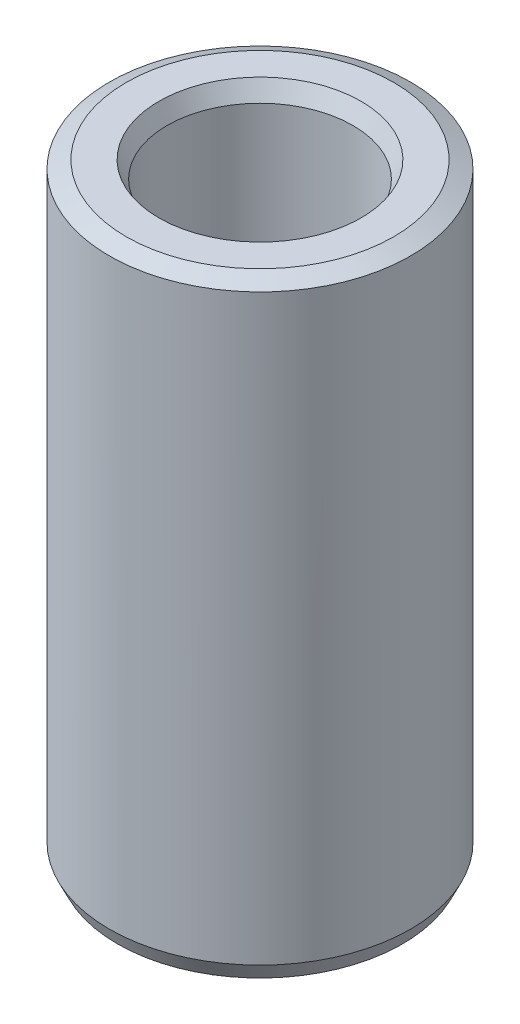
ISO-10303-21;
HEADER;
FILE_DESCRIPTION(('STEP AP214'),'2;1');
FILE_NAME('part.step','',(''),(''),'','','');
FILE_SCHEMA(('AUTOMOTIVE_DESIGN { 1 0 10303 214 1 1 1 1 }'));
ENDSEC;
DATA;
#1=APPLICATION_CONTEXT('core data for automotive mechanical design processes');
#2=APPLICATION_PROTOCOL_DEFINITION('international standard','automotive_design',2000,#1);
#3=PRODUCT_CONTEXT('',#1,'mechanical');
#4=PRODUCT('Part','Part','',(#3));
#5=PRODUCT_RELATED_PRODUCT_CATEGORY('part','',(#4));
#6=PRODUCT_DEFINITION_FORMATION('','',#4);
#7=PRODUCT_DEFINITION_CONTEXT('part definition',#1,'design');
#8=PRODUCT_DEFINITION('design','',#6,#7);
#9=PRODUCT_DEFINITION_SHAPE('','',#8);
#10=(LENGTH_UNIT() NAMED_UNIT(*) SI_UNIT(.MILLI.,.METRE.));
#11=(NAMED_UNIT(*) PLANE_ANGLE_UNIT() SI_UNIT($,.RADIAN.));
#12=(NAMED_UNIT(*) SI_UNIT($,.STERADIAN.) SOLID_ANGLE_UNIT());
#13=UNCERTAINTY_MEASURE_WITH_UNIT(LENGTH_MEASURE(1.E-05),#10,'distance_accuracy_value','');
#14=(GEOMETRIC_REPRESENTATION_CONTEXT(3) GLOBAL_UNCERTAINTY_ASSIGNED_CONTEXT((#13)) GLOBAL_UNIT_ASSIGNED_CONTEXT((#10,
#11,#12)) REPRESENTATION_CONTEXT('',''));
#15=CARTESIAN_POINT('',(0.,0.,0.));
#16=DIRECTION('',(0.,0.,1.));
#17=DIRECTION('',(1.,0.,0.));
#18=AXIS2_PLACEMENT_3D('',#15,#16,#17);
#19=CARTESIAN_POINT('',(0.,232.12143112946,0.));
#20=DIRECTION('',(0.,-1.,0.));
#21=DIRECTION('',(0.,0.,-1.));
#22=AXIS2_PLACEMENT_3D('',#19,#20,#21);
#23=CYLINDRICAL_SURFACE('',#22,57.5);
#24=CARTESIAN_POINT('',(0.,6.45651288711924,0.));
#25=DIRECTION('',(0.,1.,0.));
#26=DIRECTION('',(0.,0.,1.));
#27=AXIS2_PLACEMENT_3D('',#24,#25,#26);
#28=CIRCLE('',#27,57.5);
#29=CARTESIAN_POINT('',(0.,6.45651288711921,-57.5));
#30=VERTEX_POINT('',#29);
#31=EDGE_CURVE('E10',#30,#30,#28,.T.);
#32=CARTESIAN_POINT('',(0.,229.018245278419,0.));
#33=DIRECTION('',(0.,1.,0.));
#34=DIRECTION('',(0.,0.,1.));
#35=AXIS2_PLACEMENT_3D('',#32,#33,#34);
#36=CIRCLE('',#35,57.5);
#37=CARTESIAN_POINT('',(0.,229.018245278419,-57.5));
#38=VERTEX_POINT('',#37);
#39=EDGE_CURVE('E50',#38,#38,#36,.F.);
#40=CARTESIAN_POINT('',(0.,6.45651288711921,-57.5));
#41=CARTESIAN_POINT('',(0.,8.77486426619524,-57.5));
#42=CARTESIAN_POINT('',(0.,11.0932156452713,-57.5));
#43=CARTESIAN_POINT('',(0.,15.7299184034233,-57.5));
#44=CARTESIAN_POINT('',(0.,18.0482697824994,-57.5));
#45=CARTESIAN_POINT('',(0.,22.6849725406515,-57.5));
#46=CARTESIAN_POINT('',(0.,25.0033239197275,-57.5));
#47=CARTESIAN_POINT('',(0.,29.6400266778796,-57.5));
#48=CARTESIAN_POINT('',(0.,31.9583780569556,-57.5));
#49=CARTESIAN_POINT('',(0.,36.5950808151077,-57.5));
#50=CARTESIAN_POINT('',(0.,38.9134321941837,-57.5));
#51=CARTESIAN_POINT('',(0.,43.5501349523358,-57.5));
#52=CARTESIAN_POINT('',(0.,45.8684863314118,-57.5));
#53=CARTESIAN_POINT('',(0.,50.5051890895639,-57.5));
#54=CARTESIAN_POINT('',(0.,52.8235404686399,-57.5));
#55=CARTESIAN_POINT('',(0.,57.460243226792,-57.5));
#56=CARTESIAN_POINT('',(0.,59.7785946058681,-57.5));
#57=CARTESIAN_POINT('',(0.,64.4152973640201,-57.5));
#58=CARTESIAN_POINT('',(0.,66.7336487430962,-57.5));
#59=CARTESIAN_POINT('',(0.,71.3703515012482,-57.5));
#60=CARTESIAN_POINT('',(0.,73.6887028803243,-57.5));
#61=CARTESIAN_POINT('',(0.,78.3254056384764,-57.5));
#62=CARTESIAN_POINT('',(0.,80.6437570175524,-57.5));
#63=CARTESIAN_POINT('',(0.,85.2804597757045,-57.5));
#64=CARTESIAN_POINT('',(0.,87.5988111547805,-57.5));
#65=CARTESIAN_POINT('',(0.,92.2355139129326,-57.5));
#66=CARTESIAN_POINT('',(0.,94.5538652920086,-57.5));
#67=CARTESIAN_POINT('',(0.,99.1905680501607,-57.5));
#68=CARTESIAN_POINT('',(0.,101.508919429237,-57.5));
#69=CARTESIAN_POINT('',(0.,106.145622187389,-57.5));
#70=CARTESIAN_POINT('',(0.,108.463973566465,-57.5));
#71=CARTESIAN_POINT('',(0.,113.100676324617,-57.5));
#72=CARTESIAN_POINT('',(0.,115.419027703693,-57.5));
#73=CARTESIAN_POINT('',(0.,120.055730461845,-57.5));
#74=CARTESIAN_POINT('',(0.,122.374081840921,-57.5));
#75=CARTESIAN_POINT('',(0.,127.010784599073,-57.5));
#76=CARTESIAN_POINT('',(0.,129.329135978149,-57.5));
#77=CARTESIAN_POINT('',(0.,133.965838736301,-57.5));
#78=CARTESIAN_POINT('',(0.,136.284190115377,-57.5));
#79=CARTESIAN_POINT('',(0.,140.920892873529,-57.5));
#80=CARTESIAN_POINT('',(0.,143.239244252605,-57.5));
#81=CARTESIAN_POINT('',(0.,147.875947010757,-57.5));
#82=CARTESIAN_POINT('',(0.,150.194298389834,-57.5));
#83=CARTESIAN_POINT('',(0.,154.831001147986,-57.5));
#84=CARTESIAN_POINT('',(0.,157.149352527062,-57.5));
#85=CARTESIAN_POINT('',(0.,161.786055285214,-57.5));
#86=CARTESIAN_POINT('',(0.,164.10440666429,-57.5));
#87=CARTESIAN_POINT('',(0.,168.741109422442,-57.5));
#88=CARTESIAN_POINT('',(0.,171.059460801518,-57.5));
#89=CARTESIAN_POINT('',(0.,175.69616355967,-57.5));
#90=CARTESIAN_POINT('',(0.,178.014514938746,-57.5));
#91=CARTESIAN_POINT('',(0.,182.651217696898,-57.5));
#92=CARTESIAN_POINT('',(0.,184.969569075974,-57.5));
#93=CARTESIAN_POINT('',(0.,189.606271834126,-57.5));
#94=CARTESIAN_POINT('',(0.,191.924623213202,-57.5));
#95=CARTESIAN_POINT('',(0.,196.561325971354,-57.5));
#96=CARTESIAN_POINT('',(0.,198.87967735043,-57.5));
#97=CARTESIAN_POINT('',(0.,203.516380108582,-57.5));
#98=CARTESIAN_POINT('',(0.,205.834731487658,-57.5));
#99=CARTESIAN_POINT('',(0.,210.47143424581,-57.5));
#100=CARTESIAN_POINT('',(0.,212.789785624886,-57.5));
#101=CARTESIAN_POINT('',(0.,217.426488383039,-57.5));
#102=CARTESIAN_POINT('',(0.,219.744839762115,-57.5));
#103=CARTESIAN_POINT('',(0.,224.381542520267,-57.5));
#104=CARTESIAN_POINT('',(0.,226.699893899343,-57.5));
#105=CARTESIAN_POINT('',(0.,229.018245278419,-57.5));
#106=B_SPLINE_CURVE_WITH_KNOTS('',3,(#40,#41,#42,#43,#44,#45,#46,#47,#48,#49,#50,#51,#52,#53,
#54,#55,#56,#57,#58,#59,#60,#61,#62,#63,#64,#65,#66,#67,#68,#69,#70,#71,#72,#73,#74,#75,#76,#77,
#78,#79,#80,#81,#82,#83,#84,#85,#86,#87,#88,#89,#90,#91,#92,#93,#94,#95,#96,#97,#98,#99,#100,
#101,#102,#103,#104,#105),.UNSPECIFIED.,.F.,.F.,(4,2,2,2,2,2,2,2,2,2,2,2,2,2,2,2,2,2,2,2,2,2,2,
2,2,2,2,2,2,2,2,2,4),(0.,6.95505413722811,13.9101082744562,20.8651624116843,27.8202165489125,
34.7752706861406,41.7303248233687,48.6853789605968,55.6404330978249,62.595487235053,
69.5505413722811,76.5055955095092,83.4606496467373,90.4157037839655,97.3707579211935,
104.325812058422,111.28086619565,118.235920332878,125.190974470106,132.146028607334,
139.101082744562,146.05613688179,153.011191019018,159.966245156247,166.921299293475,
173.876353430703,180.831407567931,187.786461705159,194.741515842387,201.696569979615,
208.651624116843,215.606678254071,222.5617323913),.UNSPECIFIED.);
#107=EDGE_CURVE('BSEAM39',#30,#38,#106,.T.);
#108=ORIENTED_EDGE('',*,*,#31,.T.);
#109=ORIENTED_EDGE('',*,*,#39,.T.);
#110=ORIENTED_EDGE('',*,*,#107,.T.);
#111=ORIENTED_EDGE('',*,*,#107,.F.);
#112=EDGE_LOOP('',(#108,#110,#109,#111));
#113=FACE_BOUND('',#112,.T.);
#114=ADVANCED_FACE('F39',(#113),#23,.T.);
#115=CARTESIAN_POINT('',(0.,232.12143112946,0.));
#116=DIRECTION('',(0.,1.,0.));
#117=DIRECTION('',(0.,0.,1.));
#118=AXIS2_PLACEMENT_3D('',#115,#116,#117);
#119=PLANE('',#118);
#120=CARTESIAN_POINT('',(0.,232.12143112946,0.));
#121=DIRECTION('',(0.,1.,0.));
#122=DIRECTION('',(0.,0.,1.));
#123=AXIS2_PLACEMENT_3D('',#120,#121,#122);
#124=CIRCLE('',#123,38.5863018236428);
#125=CARTESIAN_POINT('',(0.,232.12143112946,38.5863018236428));
#126=VERTEX_POINT('',#125);
#127=EDGE_CURVE('E58',#126,#126,#124,.F.);
#128=ORIENTED_EDGE('',*,*,#127,.T.);
#129=EDGE_LOOP('',(#128));
#130=FACE_BOUND('',#129,.T.);
#131=CARTESIAN_POINT('',(0.,232.12143112946,0.));
#132=DIRECTION('',(0.,1.,0.));
#133=DIRECTION('',(0.,0.,1.));
#134=AXIS2_PLACEMENT_3D('',#131,#132,#133);
#135=CIRCLE('',#134,51.0434871128815);
#136=CARTESIAN_POINT('',(0.,232.12143112946,51.0434871128815));
#137=VERTEX_POINT('',#136);
#138=EDGE_CURVE('E61',#137,#137,#135,.T.);
#139=ORIENTED_EDGE('',*,*,#138,.T.);
#140=EDGE_LOOP('',(#139));
#141=FACE_BOUND('',#140,.T.);
#142=ADVANCED_FACE('F88',(#130,#141),#119,.T.);
#143=CARTESIAN_POINT('',(0.,0.,0.));
#144=DIRECTION('',(0.,1.,0.));
#145=DIRECTION('',(0.,0.,1.));
#146=AXIS2_PLACEMENT_3D('',#143,#144,#145);
#147=PLANE('',#146);
#148=CARTESIAN_POINT('',(0.,0.,0.));
#149=DIRECTION('',(0.,1.,0.));
#150=DIRECTION('',(0.,0.,1.));
#151=AXIS2_PLACEMENT_3D('',#148,#149,#150);
#152=CIRCLE('',#151,41.9396288597201);
#153=CARTESIAN_POINT('',(0.,0.,41.9396288597201));
#154=VERTEX_POINT('',#153);
#155=EDGE_CURVE('E51',#154,#154,#152,.T.);
#156=ORIENTED_EDGE('',*,*,#155,.T.);
#157=EDGE_LOOP('',(#156));
#158=FACE_BOUND('',#157,.T.);
#159=CARTESIAN_POINT('',(0.,0.,0.));
#160=DIRECTION('',(0.,1.,0.));
#161=DIRECTION('',(0.,0.,1.));
#162=AXIS2_PLACEMENT_3D('',#159,#160,#161);
#163=CIRCLE('',#162,54.3968141489586);
#164=CARTESIAN_POINT('',(0.,0.,54.3968141489586));
#165=VERTEX_POINT('',#164);
#166=EDGE_CURVE('E54',#165,#165,#163,.F.);
#167=ORIENTED_EDGE('',*,*,#166,.T.);
#168=EDGE_LOOP('',(#167));
#169=FACE_BOUND('',#168,.T.);
#170=ADVANCED_FACE('F83',(#158,#169),#147,.F.);
#171=CARTESIAN_POINT('',(0.,232.12143112946,0.));
#172=DIRECTION('',(0.,-1.,0.));
#173=DIRECTION('',(0.,0.,-1.));
#174=AXIS2_PLACEMENT_3D('',#171,#172,#173);
#175=CYLINDRICAL_SURFACE('',#174,35.4831159726015);
#176=CARTESIAN_POINT('',(0.,225.664918242341,0.));
#177=DIRECTION('',(0.,1.,0.));
#178=DIRECTION('',(0.,0.,1.));
#179=AXIS2_PLACEMENT_3D('',#176,#177,#178);
#180=CIRCLE('',#179,35.4831159726015);
#181=CARTESIAN_POINT('',(0.,225.664918242341,-35.4831159726015));
#182=VERTEX_POINT('',#181);
#183=EDGE_CURVE('E67',#182,#182,#180,.T.);
#184=CARTESIAN_POINT('',(0.,3.10318585104108,0.));
#185=DIRECTION('',(0.,1.,0.));
#186=DIRECTION('',(0.,0.,1.));
#187=AXIS2_PLACEMENT_3D('',#184,#185,#186);
#188=CIRCLE('',#187,35.4831159726015);
#189=CARTESIAN_POINT('',(0.,3.10318585104105,-35.4831159726015));
#190=VERTEX_POINT('',#189);
#191=EDGE_CURVE('E69',#190,#190,#188,.F.);
#192=CARTESIAN_POINT('',(0.,225.664918242341,-35.4831159726015));
#193=CARTESIAN_POINT('',(0.,223.346566863265,-35.4831159726015));
#194=CARTESIAN_POINT('',(0.,221.028215484189,-35.4831159726015));
#195=CARTESIAN_POINT('',(0.,216.391512726037,-35.4831159726015));
#196=CARTESIAN_POINT('',(0.,214.073161346961,-35.4831159726015));
#197=CARTESIAN_POINT('',(0.,209.436458588809,-35.4831159726015));
#198=CARTESIAN_POINT('',(0.,207.118107209732,-35.4831159726015));
#199=CARTESIAN_POINT('',(0.,202.48140445158,-35.4831159726015));
#200=CARTESIAN_POINT('',(0.,200.163053072504,-35.4831159726015));
#201=CARTESIAN_POINT('',(0.,195.526350314352,-35.4831159726015));
#202=CARTESIAN_POINT('',(0.,193.207998935276,-35.4831159726015));
#203=CARTESIAN_POINT('',(0.,188.571296177124,-35.4831159726015));
#204=CARTESIAN_POINT('',(0.,186.252944798048,-35.4831159726015));
#205=CARTESIAN_POINT('',(0.,181.616242039896,-35.4831159726015));
#206=CARTESIAN_POINT('',(0.,179.29789066082,-35.4831159726015));
#207=CARTESIAN_POINT('',(0.,174.661187902668,-35.4831159726015));
#208=CARTESIAN_POINT('',(0.,172.342836523592,-35.4831159726015));
#209=CARTESIAN_POINT('',(0.,167.70613376544,-35.4831159726015));
#210=CARTESIAN_POINT('',(0.,165.387782386364,-35.4831159726015));
#211=CARTESIAN_POINT('',(0.,160.751079628212,-35.4831159726015));
#212=CARTESIAN_POINT('',(0.,158.432728249136,-35.4831159726015));
#213=CARTESIAN_POINT('',(0.,153.796025490984,-35.4831159726015));
#214=CARTESIAN_POINT('',(0.,151.477674111908,-35.4831159726015));
#215=CARTESIAN_POINT('',(0.,146.840971353755,-35.4831159726015));
#216=CARTESIAN_POINT('',(0.,144.522619974679,-35.4831159726015));
#217=CARTESIAN_POINT('',(0.,139.885917216527,-35.4831159726015));
#218=CARTESIAN_POINT('',(0.,137.567565837451,-35.4831159726015));
#219=CARTESIAN_POINT('',(0.,132.930863079299,-35.4831159726015));
#220=CARTESIAN_POINT('',(0.,130.612511700223,-35.4831159726015));
#221=CARTESIAN_POINT('',(0.,125.975808942071,-35.4831159726015));
#222=CARTESIAN_POINT('',(0.,123.657457562995,-35.4831159726015));
#223=CARTESIAN_POINT('',(0.,119.020754804843,-35.4831159726015));
#224=CARTESIAN_POINT('',(0.,116.702403425767,-35.4831159726015));
#225=CARTESIAN_POINT('',(0.,112.065700667615,-35.4831159726015));
#226=CARTESIAN_POINT('',(0.,109.747349288539,-35.4831159726015));
#227=CARTESIAN_POINT('',(0.,105.110646530387,-35.4831159726015));
#228=CARTESIAN_POINT('',(0.,102.792295151311,-35.4831159726015));
#229=CARTESIAN_POINT('',(0.,98.1555923931587,-35.4831159726015));
#230=CARTESIAN_POINT('',(0.,95.8372410140826,-35.4831159726015));
#231=CARTESIAN_POINT('',(0.,91.2005382559305,-35.4831159726015));
#232=CARTESIAN_POINT('',(0.,88.8821868768545,-35.4831159726015));
#233=CARTESIAN_POINT('',(0.,84.2454841187024,-35.4831159726015));
#234=CARTESIAN_POINT('',(0.,81.9271327396264,-35.4831159726015));
#235=CARTESIAN_POINT('',(0.,77.2904299814743,-35.4831159726015));
#236=CARTESIAN_POINT('',(0.,74.9720786023983,-35.4831159726015));
#237=CARTESIAN_POINT('',(0.,70.3353758442462,-35.4831159726015));
#238=CARTESIAN_POINT('',(0.,68.0170244651701,-35.4831159726015));
#239=CARTESIAN_POINT('',(0.,63.3803217070181,-35.4831159726015));
#240=CARTESIAN_POINT('',(0.,61.061970327942,-35.4831159726015));
#241=CARTESIAN_POINT('',(0.,56.42526756979,-35.4831159726015));
#242=CARTESIAN_POINT('',(0.,54.1069161907139,-35.4831159726015));
#243=CARTESIAN_POINT('',(0.,49.4702134325618,-35.4831159726015));
#244=CARTESIAN_POINT('',(0.,47.1518620534858,-35.4831159726015));
#245=CARTESIAN_POINT('',(0.,42.5151592953337,-35.4831159726015));
#246=CARTESIAN_POINT('',(0.,40.1968079162577,-35.4831159726015));
#247=CARTESIAN_POINT('',(0.,35.5601051581056,-35.4831159726015));
#248=CARTESIAN_POINT('',(0.,33.2417537790296,-35.4831159726015));
#249=CARTESIAN_POINT('',(0.,28.6050510208775,-35.4831159726015));
#250=CARTESIAN_POINT('',(0.,26.2866996418014,-35.4831159726015));
#251=CARTESIAN_POINT('',(0.,21.6499968836494,-35.4831159726015));
#252=CARTESIAN_POINT('',(0.,19.3316455045733,-35.4831159726015));
#253=CARTESIAN_POINT('',(0.,14.6949427464213,-35.4831159726015));
#254=CARTESIAN_POINT('',(0.,12.3765913673452,-35.4831159726015));
#255=CARTESIAN_POINT('',(0.,7.73988860919314,-35.4831159726015));
#256=CARTESIAN_POINT('',(0.,5.42153723011709,-35.4831159726015));
#257=CARTESIAN_POINT('',(0.,3.10318585104105,-35.4831159726015));
#258=B_SPLINE_CURVE_WITH_KNOTS('',3,(#192,#193,#194,#195,#196,#197,#198,#199,#200,#201,#202,
#203,#204,#205,#206,#207,#208,#209,#210,#211,#212,#213,#214,#215,#216,#217,#218,#219,#220,#221,
#222,#223,#224,#225,#226,#227,#228,#229,#230,#231,#232,#233,#234,#235,#236,#237,#238,#239,#240,
#241,#242,#243,#244,#245,#246,#247,#248,#249,#250,#251,#252,#253,#254,#255,#256,#257),
.UNSPECIFIED.,.F.,.F.,(4,2,2,2,2,2,2,2,2,2,2,2,2,2,2,2,2,2,2,2,2,2,2,2,2,2,2,2,2,2,2,2,4),(0.,
6.95505413722813,13.9101082744562,20.8651624116844,27.8202165489125,34.7752706861406,
41.7303248233687,48.6853789605968,55.6404330978249,62.5954872350531,69.5505413722812,
76.5055955095093,83.4606496467374,90.4157037839655,97.3707579211936,104.325812058422,
111.28086619565,118.235920332878,125.190974470106,132.146028607334,139.101082744562,
146.05613688179,153.011191019019,159.966245156247,166.921299293475,173.876353430703,
180.831407567931,187.786461705159,194.741515842387,201.696569979615,208.651624116843,
215.606678254072,222.5617323913),.UNSPECIFIED.);
#259=EDGE_CURVE('BSEAM71',#182,#190,#258,.T.);
#260=ORIENTED_EDGE('',*,*,#183,.T.);
#261=ORIENTED_EDGE('',*,*,#191,.T.);
#262=ORIENTED_EDGE('',*,*,#259,.T.);
#263=ORIENTED_EDGE('',*,*,#259,.F.);
#264=EDGE_LOOP('',(#260,#262,#261,#263));
#265=FACE_BOUND('',#264,.T.);
#266=ADVANCED_FACE('F71',(#265),#175,.F.);
#267=CARTESIAN_POINT('',(0.,225.664918242341,0.));
#268=DIRECTION('',(0.,1.,0.));
#269=DIRECTION('',(0.,0.,1.));
#270=AXIS2_PLACEMENT_3D('',#267,#268,#269);
#271=CONICAL_SURFACE('',#270,35.4831159726015,0.448030879179841);
#272=ORIENTED_EDGE('',*,*,#127,.F.);
#273=EDGE_LOOP('',(#272));
#274=FACE_BOUND('',#273,.T.);
#275=ORIENTED_EDGE('',*,*,#183,.F.);
#276=EDGE_LOOP('',(#275));
#277=FACE_BOUND('',#276,.T.);
#278=ADVANCED_FACE('F77',(#274,#277),#271,.F.);
#279=CARTESIAN_POINT('',(0.,0.,0.));
#280=DIRECTION('',(0.,-1.,0.));
#281=DIRECTION('',(0.,0.,-1.));
#282=AXIS2_PLACEMENT_3D('',#279,#280,#281);
#283=CONICAL_SURFACE('',#282,41.9396288597201,1.12276544761506);
#284=ORIENTED_EDGE('',*,*,#191,.F.);
#285=EDGE_LOOP('',(#284));
#286=FACE_BOUND('',#285,.T.);
#287=ORIENTED_EDGE('',*,*,#155,.F.);
#288=EDGE_LOOP('',(#287));
#289=FACE_BOUND('',#288,.T.);
#290=ADVANCED_FACE('F73',(#286,#289),#283,.F.);
#291=CARTESIAN_POINT('',(0.,6.45651288711924,0.));
#292=DIRECTION('',(0.,1.,0.));
#293=DIRECTION('',(0.,0.,1.));
#294=AXIS2_PLACEMENT_3D('',#291,#292,#293);
#295=CONICAL_SURFACE('',#294,57.5,0.448030879179842);
#296=ORIENTED_EDGE('',*,*,#166,.F.);
#297=EDGE_LOOP('',(#296));
#298=FACE_BOUND('',#297,.T.);
#299=ORIENTED_EDGE('',*,*,#31,.F.);
#300=EDGE_LOOP('',(#299));
#301=FACE_BOUND('',#300,.T.);
#302=ADVANCED_FACE('F76',(#298,#301),#295,.T.);
#303=CARTESIAN_POINT('',(0.,232.12143112946,0.));
#304=DIRECTION('',(0.,-1.,0.));
#305=DIRECTION('',(0.,0.,-1.));
#306=AXIS2_PLACEMENT_3D('',#303,#304,#305);
#307=CONICAL_SURFACE('',#306,51.0434871128815,1.12276544761505);
#308=ORIENTED_EDGE('',*,*,#39,.F.);
#309=EDGE_LOOP('',(#308));
#310=FACE_BOUND('',#309,.T.);
#311=ORIENTED_EDGE('',*,*,#138,.F.);
#312=EDGE_LOOP('',(#311));
#313=FACE_BOUND('',#312,.T.);
#314=ADVANCED_FACE('F45',(#310,#313),#307,.T.);
#315=CLOSED_SHELL('',(#114,#142,#170,#266,#278,#290,#302,#314));
#316=MANIFOLD_SOLID_BREP('B2',#315);
#317=ADVANCED_BREP_SHAPE_REPRESENTATION('',(#18,#316),#14);
#318=SHAPE_DEFINITION_REPRESENTATION(#9,#317);
ENDSEC;
END-ISO-10303-21;
